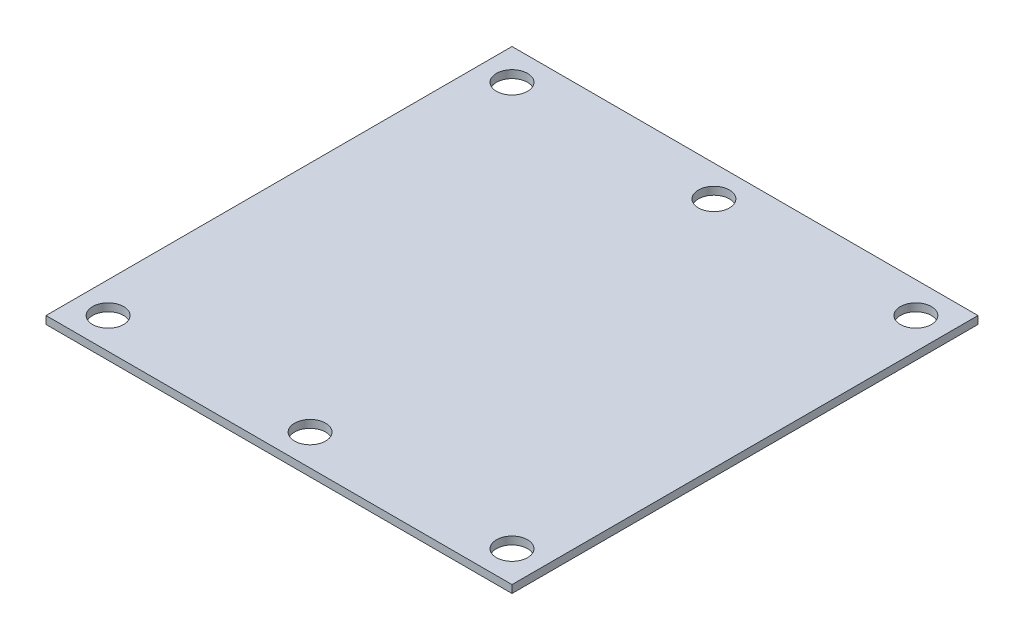
ISO-10303-21;
HEADER;
FILE_DESCRIPTION(('STEP AP214'),'2;1');
FILE_NAME('part.step','',(''),(''),'','','');
FILE_SCHEMA(('AUTOMOTIVE_DESIGN { 1 0 10303 214 1 1 1 1 }'));
ENDSEC;
DATA;
#1=APPLICATION_CONTEXT('core data for automotive mechanical design processes');
#2=APPLICATION_PROTOCOL_DEFINITION('international standard','automotive_design',2000,#1);
#3=PRODUCT_CONTEXT('',#1,'mechanical');
#4=PRODUCT('Part','Part','',(#3));
#5=PRODUCT_RELATED_PRODUCT_CATEGORY('part','',(#4));
#6=PRODUCT_DEFINITION_FORMATION('','',#4);
#7=PRODUCT_DEFINITION_CONTEXT('part definition',#1,'design');
#8=PRODUCT_DEFINITION('design','',#6,#7);
#9=PRODUCT_DEFINITION_SHAPE('','',#8);
#10=(LENGTH_UNIT() NAMED_UNIT(*) SI_UNIT(.MILLI.,.METRE.));
#11=(NAMED_UNIT(*) PLANE_ANGLE_UNIT() SI_UNIT($,.RADIAN.));
#12=(NAMED_UNIT(*) SI_UNIT($,.STERADIAN.) SOLID_ANGLE_UNIT());
#13=UNCERTAINTY_MEASURE_WITH_UNIT(LENGTH_MEASURE(1.E-05),#10,'distance_accuracy_value','');
#14=(GEOMETRIC_REPRESENTATION_CONTEXT(3) GLOBAL_UNCERTAINTY_ASSIGNED_CONTEXT((#13)) GLOBAL_UNIT_ASSIGNED_CONTEXT((#10,
#11,#12)) REPRESENTATION_CONTEXT('',''));
#15=CARTESIAN_POINT('',(0.,0.,0.));
#16=DIRECTION('',(0.,0.,1.));
#17=DIRECTION('',(1.,0.,0.));
#18=AXIS2_PLACEMENT_3D('',#15,#16,#17);
#19=CARTESIAN_POINT('',(-30.,1.,30.));
#20=DIRECTION('',(1.,0.,0.));
#21=DIRECTION('',(0.,0.,-1.));
#22=AXIS2_PLACEMENT_3D('',#19,#20,#21);
#23=PLANE('',#22);
#24=DIRECTION('',(0.,0.,1.));
#25=VECTOR('',#24,1.);
#26=CARTESIAN_POINT('',(-30.,0.,30.));
#27=LINE('',#26,#25);
#28=CARTESIAN_POINT('',(-30.,0.,-30.));
#29=VERTEX_POINT('',#28);
#30=CARTESIAN_POINT('',(-30.,0.,30.));
#31=VERTEX_POINT('',#30);
#32=EDGE_CURVE('E100',#29,#31,#27,.T.);
#33=ORIENTED_EDGE('',*,*,#32,.T.);
#34=DIRECTION('',(0.,-1.,0.));
#35=VECTOR('',#34,1.);
#36=CARTESIAN_POINT('',(-30.,1.,30.));
#37=LINE('',#36,#35);
#38=CARTESIAN_POINT('',(-30.,1.,30.));
#39=VERTEX_POINT('',#38);
#40=EDGE_CURVE('E11',#39,#31,#37,.T.);
#41=ORIENTED_EDGE('',*,*,#40,.F.);
#42=DIRECTION('',(0.,0.,1.));
#43=VECTOR('',#42,1.);
#44=CARTESIAN_POINT('',(-30.,1.,30.));
#45=LINE('',#44,#43);
#46=CARTESIAN_POINT('',(-30.,1.,-30.));
#47=VERTEX_POINT('',#46);
#48=EDGE_CURVE('E88',#47,#39,#45,.T.);
#49=ORIENTED_EDGE('',*,*,#48,.F.);
#50=DIRECTION('',(0.,-1.,0.));
#51=VECTOR('',#50,1.);
#52=CARTESIAN_POINT('',(-30.,1.,-30.));
#53=LINE('',#52,#51);
#54=EDGE_CURVE('E96',#47,#29,#53,.T.);
#55=ORIENTED_EDGE('',*,*,#54,.T.);
#56=EDGE_LOOP('',(#33,#41,#49,#55));
#57=FACE_BOUND('',#56,.T.);
#58=ADVANCED_FACE('F37',(#57),#23,.F.);
#59=CARTESIAN_POINT('',(30.,1.,30.));
#60=DIRECTION('',(0.,0.,-1.));
#61=DIRECTION('',(-1.,0.,0.));
#62=AXIS2_PLACEMENT_3D('',#59,#60,#61);
#63=PLANE('',#62);
#64=DIRECTION('',(1.,0.,0.));
#65=VECTOR('',#64,1.);
#66=CARTESIAN_POINT('',(30.,0.,30.));
#67=LINE('',#66,#65);
#68=CARTESIAN_POINT('',(30.,0.,30.));
#69=VERTEX_POINT('',#68);
#70=EDGE_CURVE('E92',#31,#69,#67,.T.);
#71=ORIENTED_EDGE('',*,*,#70,.T.);
#72=DIRECTION('',(0.,-1.,0.));
#73=VECTOR('',#72,1.);
#74=CARTESIAN_POINT('',(30.,1.,30.));
#75=LINE('',#74,#73);
#76=CARTESIAN_POINT('',(30.,1.,30.));
#77=VERTEX_POINT('',#76);
#78=EDGE_CURVE('E45',#77,#69,#75,.T.);
#79=ORIENTED_EDGE('',*,*,#78,.F.);
#80=DIRECTION('',(1.,0.,0.));
#81=VECTOR('',#80,1.);
#82=CARTESIAN_POINT('',(30.,1.,30.));
#83=LINE('',#82,#81);
#84=EDGE_CURVE('E83',#39,#77,#83,.T.);
#85=ORIENTED_EDGE('',*,*,#84,.F.);
#86=ORIENTED_EDGE('',*,*,#40,.T.);
#87=EDGE_LOOP('',(#71,#79,#85,#86));
#88=FACE_BOUND('',#87,.T.);
#89=ADVANCED_FACE('F91',(#88),#63,.F.);
#90=CARTESIAN_POINT('',(30.,1.,30.));
#91=DIRECTION('',(-1.,0.,0.));
#92=DIRECTION('',(0.,0.,1.));
#93=AXIS2_PLACEMENT_3D('',#90,#91,#92);
#94=PLANE('',#93);
#95=DIRECTION('',(0.,0.,-1.));
#96=VECTOR('',#95,1.);
#97=CARTESIAN_POINT('',(30.,0.,30.));
#98=LINE('',#97,#96);
#99=CARTESIAN_POINT('',(30.,0.,-30.));
#100=VERTEX_POINT('',#99);
#101=EDGE_CURVE('E70',#69,#100,#98,.T.);
#102=ORIENTED_EDGE('',*,*,#101,.T.);
#103=DIRECTION('',(0.,-1.,0.));
#104=VECTOR('',#103,1.);
#105=CARTESIAN_POINT('',(30.,1.,-30.));
#106=LINE('',#105,#104);
#107=CARTESIAN_POINT('',(30.,1.,-30.));
#108=VERTEX_POINT('',#107);
#109=EDGE_CURVE('E93',#108,#100,#106,.T.);
#110=ORIENTED_EDGE('',*,*,#109,.F.);
#111=DIRECTION('',(0.,0.,-1.));
#112=VECTOR('',#111,1.);
#113=CARTESIAN_POINT('',(30.,1.,30.));
#114=LINE('',#113,#112);
#115=EDGE_CURVE('E86',#77,#108,#114,.T.);
#116=ORIENTED_EDGE('',*,*,#115,.F.);
#117=ORIENTED_EDGE('',*,*,#78,.T.);
#118=EDGE_LOOP('',(#102,#110,#116,#117));
#119=FACE_BOUND('',#118,.T.);
#120=ADVANCED_FACE('F94',(#119),#94,.F.);
#121=CARTESIAN_POINT('',(30.,1.,-30.));
#122=DIRECTION('',(0.,0.,1.));
#123=DIRECTION('',(1.,0.,0.));
#124=AXIS2_PLACEMENT_3D('',#121,#122,#123);
#125=PLANE('',#124);
#126=DIRECTION('',(-1.,0.,0.));
#127=VECTOR('',#126,1.);
#128=CARTESIAN_POINT('',(30.,0.,-30.));
#129=LINE('',#128,#127);
#130=EDGE_CURVE('E76',#100,#29,#129,.T.);
#131=ORIENTED_EDGE('',*,*,#130,.T.);
#132=ORIENTED_EDGE('',*,*,#54,.F.);
#133=DIRECTION('',(-1.,0.,0.));
#134=VECTOR('',#133,1.);
#135=CARTESIAN_POINT('',(30.,1.,-30.));
#136=LINE('',#135,#134);
#137=EDGE_CURVE('E53',#108,#47,#136,.T.);
#138=ORIENTED_EDGE('',*,*,#137,.F.);
#139=ORIENTED_EDGE('',*,*,#109,.T.);
#140=EDGE_LOOP('',(#131,#132,#138,#139));
#141=FACE_BOUND('',#140,.T.);
#142=ADVANCED_FACE('F108',(#141),#125,.F.);
#143=CARTESIAN_POINT('',(0.,1.,0.));
#144=DIRECTION('',(0.,1.,0.));
#145=DIRECTION('',(0.,0.,1.));
#146=AXIS2_PLACEMENT_3D('',#143,#144,#145);
#147=PLANE('',#146);
#148=CARTESIAN_POINT('',(26.,1.,-26.));
#149=DIRECTION('',(0.,1.,0.));
#150=DIRECTION('',(0.,0.,1.));
#151=AXIS2_PLACEMENT_3D('',#148,#149,#150);
#152=CIRCLE('',#151,2.);
#153=CARTESIAN_POINT('',(26.,1.,-24.));
#154=VERTEX_POINT('',#153);
#155=EDGE_CURVE('E146',#154,#154,#152,.T.);
#156=ORIENTED_EDGE('',*,*,#155,.F.);
#157=EDGE_LOOP('',(#156));
#158=FACE_BOUND('',#157,.T.);
#159=CARTESIAN_POINT('',(0.,1.,-26.));
#160=DIRECTION('',(0.,1.,0.));
#161=DIRECTION('',(0.,0.,1.));
#162=AXIS2_PLACEMENT_3D('',#159,#160,#161);
#163=CIRCLE('',#162,2.);
#164=CARTESIAN_POINT('',(0.,1.,-24.));
#165=VERTEX_POINT('',#164);
#166=EDGE_CURVE('E140',#165,#165,#163,.T.);
#167=ORIENTED_EDGE('',*,*,#166,.F.);
#168=EDGE_LOOP('',(#167));
#169=FACE_BOUND('',#168,.T.);
#170=CARTESIAN_POINT('',(-26.,1.,-26.));
#171=DIRECTION('',(0.,1.,0.));
#172=DIRECTION('',(0.,0.,1.));
#173=AXIS2_PLACEMENT_3D('',#170,#171,#172);
#174=CIRCLE('',#173,2.);
#175=CARTESIAN_POINT('',(-26.,1.,-24.));
#176=VERTEX_POINT('',#175);
#177=EDGE_CURVE('E134',#176,#176,#174,.T.);
#178=ORIENTED_EDGE('',*,*,#177,.F.);
#179=EDGE_LOOP('',(#178));
#180=FACE_BOUND('',#179,.T.);
#181=CARTESIAN_POINT('',(0.,1.,26.));
#182=DIRECTION('',(0.,1.,0.));
#183=DIRECTION('',(0.,0.,1.));
#184=AXIS2_PLACEMENT_3D('',#181,#182,#183);
#185=CIRCLE('',#184,2.);
#186=CARTESIAN_POINT('',(0.,1.,28.));
#187=VERTEX_POINT('',#186);
#188=EDGE_CURVE('E128',#187,#187,#185,.T.);
#189=ORIENTED_EDGE('',*,*,#188,.F.);
#190=EDGE_LOOP('',(#189));
#191=FACE_BOUND('',#190,.T.);
#192=CARTESIAN_POINT('',(26.,1.,26.));
#193=DIRECTION('',(0.,1.,0.));
#194=DIRECTION('',(0.,0.,1.));
#195=AXIS2_PLACEMENT_3D('',#192,#193,#194);
#196=CIRCLE('',#195,2.);
#197=CARTESIAN_POINT('',(26.,1.,28.));
#198=VERTEX_POINT('',#197);
#199=EDGE_CURVE('E122',#198,#198,#196,.T.);
#200=ORIENTED_EDGE('',*,*,#199,.F.);
#201=EDGE_LOOP('',(#200));
#202=FACE_BOUND('',#201,.T.);
#203=CARTESIAN_POINT('',(-26.,1.,26.));
#204=DIRECTION('',(0.,1.,0.));
#205=DIRECTION('',(0.,0.,1.));
#206=AXIS2_PLACEMENT_3D('',#203,#204,#205);
#207=CIRCLE('',#206,2.);
#208=CARTESIAN_POINT('',(-26.,1.,28.));
#209=VERTEX_POINT('',#208);
#210=EDGE_CURVE('E116',#209,#209,#207,.T.);
#211=ORIENTED_EDGE('',*,*,#210,.F.);
#212=EDGE_LOOP('',(#211));
#213=FACE_BOUND('',#212,.T.);
#214=ORIENTED_EDGE('',*,*,#48,.T.);
#215=ORIENTED_EDGE('',*,*,#84,.T.);
#216=ORIENTED_EDGE('',*,*,#115,.T.);
#217=ORIENTED_EDGE('',*,*,#137,.T.);
#218=EDGE_LOOP('',(#214,#215,#216,#217));
#219=FACE_BOUND('',#218,.T.);
#220=ADVANCED_FACE('F84',(#158,#169,#180,#191,#202,#213,#219),#147,.T.);
#221=CARTESIAN_POINT('',(0.,0.,0.));
#222=DIRECTION('',(0.,1.,0.));
#223=DIRECTION('',(0.,0.,1.));
#224=AXIS2_PLACEMENT_3D('',#221,#222,#223);
#225=PLANE('',#224);
#226=CARTESIAN_POINT('',(26.,0.,-26.));
#227=DIRECTION('',(0.,1.,0.));
#228=DIRECTION('',(0.,0.,1.));
#229=AXIS2_PLACEMENT_3D('',#226,#227,#228);
#230=CIRCLE('',#229,2.);
#231=CARTESIAN_POINT('',(26.,0.,-24.));
#232=VERTEX_POINT('',#231);
#233=EDGE_CURVE('E143',#232,#232,#230,.T.);
#234=ORIENTED_EDGE('',*,*,#233,.T.);
#235=EDGE_LOOP('',(#234));
#236=FACE_BOUND('',#235,.T.);
#237=CARTESIAN_POINT('',(0.,0.,-26.));
#238=DIRECTION('',(0.,1.,0.));
#239=DIRECTION('',(0.,0.,1.));
#240=AXIS2_PLACEMENT_3D('',#237,#238,#239);
#241=CIRCLE('',#240,2.);
#242=CARTESIAN_POINT('',(0.,0.,-24.));
#243=VERTEX_POINT('',#242);
#244=EDGE_CURVE('E137',#243,#243,#241,.T.);
#245=ORIENTED_EDGE('',*,*,#244,.T.);
#246=EDGE_LOOP('',(#245));
#247=FACE_BOUND('',#246,.T.);
#248=CARTESIAN_POINT('',(-26.,0.,-26.));
#249=DIRECTION('',(0.,1.,0.));
#250=DIRECTION('',(0.,0.,1.));
#251=AXIS2_PLACEMENT_3D('',#248,#249,#250);
#252=CIRCLE('',#251,2.);
#253=CARTESIAN_POINT('',(-26.,0.,-24.));
#254=VERTEX_POINT('',#253);
#255=EDGE_CURVE('E131',#254,#254,#252,.T.);
#256=ORIENTED_EDGE('',*,*,#255,.T.);
#257=EDGE_LOOP('',(#256));
#258=FACE_BOUND('',#257,.T.);
#259=CARTESIAN_POINT('',(0.,0.,26.));
#260=DIRECTION('',(0.,1.,0.));
#261=DIRECTION('',(0.,0.,1.));
#262=AXIS2_PLACEMENT_3D('',#259,#260,#261);
#263=CIRCLE('',#262,2.);
#264=CARTESIAN_POINT('',(0.,0.,28.));
#265=VERTEX_POINT('',#264);
#266=EDGE_CURVE('E125',#265,#265,#263,.T.);
#267=ORIENTED_EDGE('',*,*,#266,.T.);
#268=EDGE_LOOP('',(#267));
#269=FACE_BOUND('',#268,.T.);
#270=CARTESIAN_POINT('',(26.,0.,26.));
#271=DIRECTION('',(0.,1.,0.));
#272=DIRECTION('',(0.,0.,1.));
#273=AXIS2_PLACEMENT_3D('',#270,#271,#272);
#274=CIRCLE('',#273,2.);
#275=CARTESIAN_POINT('',(26.,0.,28.));
#276=VERTEX_POINT('',#275);
#277=EDGE_CURVE('E119',#276,#276,#274,.T.);
#278=ORIENTED_EDGE('',*,*,#277,.T.);
#279=EDGE_LOOP('',(#278));
#280=FACE_BOUND('',#279,.T.);
#281=CARTESIAN_POINT('',(-26.,0.,26.));
#282=DIRECTION('',(0.,1.,0.));
#283=DIRECTION('',(0.,0.,1.));
#284=AXIS2_PLACEMENT_3D('',#281,#282,#283);
#285=CIRCLE('',#284,2.);
#286=CARTESIAN_POINT('',(-26.,0.,28.));
#287=VERTEX_POINT('',#286);
#288=EDGE_CURVE('E103',#287,#287,#285,.T.);
#289=ORIENTED_EDGE('',*,*,#288,.T.);
#290=EDGE_LOOP('',(#289));
#291=FACE_BOUND('',#290,.T.);
#292=ORIENTED_EDGE('',*,*,#32,.F.);
#293=ORIENTED_EDGE('',*,*,#130,.F.);
#294=ORIENTED_EDGE('',*,*,#101,.F.);
#295=ORIENTED_EDGE('',*,*,#70,.F.);
#296=EDGE_LOOP('',(#292,#293,#294,#295));
#297=FACE_BOUND('',#296,.T.);
#298=ADVANCED_FACE('F111',(#236,#247,#258,#269,#280,#291,#297),#225,.F.);
#299=CARTESIAN_POINT('',(-26.,1.,26.));
#300=DIRECTION('',(0.,1.,0.));
#301=DIRECTION('',(0.,0.,1.));
#302=AXIS2_PLACEMENT_3D('',#299,#300,#301);
#303=CYLINDRICAL_SURFACE('',#302,2.);
#304=ORIENTED_EDGE('',*,*,#288,.F.);
#305=EDGE_LOOP('',(#304));
#306=FACE_BOUND('',#305,.T.);
#307=ORIENTED_EDGE('',*,*,#210,.T.);
#308=EDGE_LOOP('',(#307));
#309=FACE_BOUND('',#308,.T.);
#310=ADVANCED_FACE('F165',(#306,#309),#303,.F.);
#311=CARTESIAN_POINT('',(26.,1.,26.));
#312=DIRECTION('',(0.,1.,0.));
#313=DIRECTION('',(0.,0.,1.));
#314=AXIS2_PLACEMENT_3D('',#311,#312,#313);
#315=CYLINDRICAL_SURFACE('',#314,2.);
#316=ORIENTED_EDGE('',*,*,#277,.F.);
#317=EDGE_LOOP('',(#316));
#318=FACE_BOUND('',#317,.T.);
#319=ORIENTED_EDGE('',*,*,#199,.T.);
#320=EDGE_LOOP('',(#319));
#321=FACE_BOUND('',#320,.T.);
#322=ADVANCED_FACE('F167',(#318,#321),#315,.F.);
#323=CARTESIAN_POINT('',(0.,1.,26.));
#324=DIRECTION('',(0.,1.,0.));
#325=DIRECTION('',(0.,0.,1.));
#326=AXIS2_PLACEMENT_3D('',#323,#324,#325);
#327=CYLINDRICAL_SURFACE('',#326,2.);
#328=ORIENTED_EDGE('',*,*,#266,.F.);
#329=EDGE_LOOP('',(#328));
#330=FACE_BOUND('',#329,.T.);
#331=ORIENTED_EDGE('',*,*,#188,.T.);
#332=EDGE_LOOP('',(#331));
#333=FACE_BOUND('',#332,.T.);
#334=ADVANCED_FACE('F174',(#330,#333),#327,.F.);
#335=CARTESIAN_POINT('',(-26.,1.,-26.));
#336=DIRECTION('',(0.,1.,0.));
#337=DIRECTION('',(0.,0.,1.));
#338=AXIS2_PLACEMENT_3D('',#335,#336,#337);
#339=CYLINDRICAL_SURFACE('',#338,2.);
#340=ORIENTED_EDGE('',*,*,#255,.F.);
#341=EDGE_LOOP('',(#340));
#342=FACE_BOUND('',#341,.T.);
#343=ORIENTED_EDGE('',*,*,#177,.T.);
#344=EDGE_LOOP('',(#343));
#345=FACE_BOUND('',#344,.T.);
#346=ADVANCED_FACE('F221',(#342,#345),#339,.F.);
#347=CARTESIAN_POINT('',(0.,1.,-26.));
#348=DIRECTION('',(0.,1.,0.));
#349=DIRECTION('',(0.,0.,1.));
#350=AXIS2_PLACEMENT_3D('',#347,#348,#349);
#351=CYLINDRICAL_SURFACE('',#350,2.);
#352=ORIENTED_EDGE('',*,*,#244,.F.);
#353=EDGE_LOOP('',(#352));
#354=FACE_BOUND('',#353,.T.);
#355=ORIENTED_EDGE('',*,*,#166,.T.);
#356=EDGE_LOOP('',(#355));
#357=FACE_BOUND('',#356,.T.);
#358=ADVANCED_FACE('F231',(#354,#357),#351,.F.);
#359=CARTESIAN_POINT('',(26.,1.,-26.));
#360=DIRECTION('',(0.,1.,0.));
#361=DIRECTION('',(0.,0.,1.));
#362=AXIS2_PLACEMENT_3D('',#359,#360,#361);
#363=CYLINDRICAL_SURFACE('',#362,2.);
#364=ORIENTED_EDGE('',*,*,#233,.F.);
#365=EDGE_LOOP('',(#364));
#366=FACE_BOUND('',#365,.T.);
#367=ORIENTED_EDGE('',*,*,#155,.T.);
#368=EDGE_LOOP('',(#367));
#369=FACE_BOUND('',#368,.T.);
#370=ADVANCED_FACE('F150',(#366,#369),#363,.F.);
#371=CLOSED_SHELL('',(#58,#89,#120,#142,#220,#298,#310,#322,#334,#346,#358,#370));
#372=MANIFOLD_SOLID_BREP('B2',#371);
#373=ADVANCED_BREP_SHAPE_REPRESENTATION('',(#18,#372),#14);
#374=SHAPE_DEFINITION_REPRESENTATION(#9,#373);
ENDSEC;
END-ISO-10303-21;
